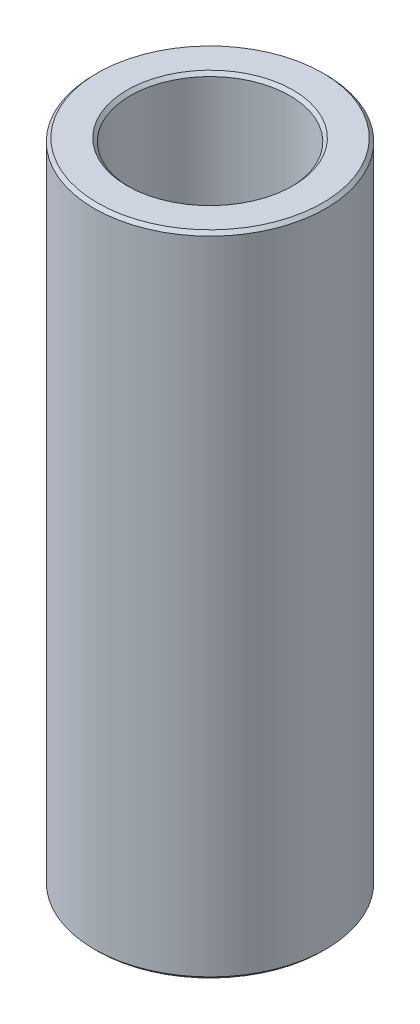
ISO-10303-21;
HEADER;
FILE_DESCRIPTION(('STEP AP214'),'2;1');
FILE_NAME('part.step','',(''),(''),'','','');
FILE_SCHEMA(('AUTOMOTIVE_DESIGN { 1 0 10303 214 1 1 1 1 }'));
ENDSEC;
DATA;
#1=APPLICATION_CONTEXT('core data for automotive mechanical design processes');
#2=APPLICATION_PROTOCOL_DEFINITION('international standard','automotive_design',2000,#1);
#3=PRODUCT_CONTEXT('',#1,'mechanical');
#4=PRODUCT('Part','Part','',(#3));
#5=PRODUCT_RELATED_PRODUCT_CATEGORY('part','',(#4));
#6=PRODUCT_DEFINITION_FORMATION('','',#4);
#7=PRODUCT_DEFINITION_CONTEXT('part definition',#1,'design');
#8=PRODUCT_DEFINITION('design','',#6,#7);
#9=PRODUCT_DEFINITION_SHAPE('','',#8);
#10=(LENGTH_UNIT() NAMED_UNIT(*) SI_UNIT(.MILLI.,.METRE.));
#11=(NAMED_UNIT(*) PLANE_ANGLE_UNIT() SI_UNIT($,.RADIAN.));
#12=(NAMED_UNIT(*) SI_UNIT($,.STERADIAN.) SOLID_ANGLE_UNIT());
#13=UNCERTAINTY_MEASURE_WITH_UNIT(LENGTH_MEASURE(1.E-05),#10,'distance_accuracy_value','');
#14=(GEOMETRIC_REPRESENTATION_CONTEXT(3) GLOBAL_UNCERTAINTY_ASSIGNED_CONTEXT((#13)) GLOBAL_UNIT_ASSIGNED_CONTEXT((#10,
#11,#12)) REPRESENTATION_CONTEXT('',''));
#15=CARTESIAN_POINT('',(0.,0.,0.));
#16=DIRECTION('',(0.,0.,1.));
#17=DIRECTION('',(1.,0.,0.));
#18=AXIS2_PLACEMENT_3D('',#15,#16,#17);
#19=CARTESIAN_POINT('',(0.,251.729088074632,0.));
#20=DIRECTION('',(0.,-1.,0.));
#21=DIRECTION('',(0.,0.,-1.));
#22=AXIS2_PLACEMENT_3D('',#19,#20,#21);
#23=CYLINDRICAL_SURFACE('',#22,45.);
#24=CARTESIAN_POINT('',(0.,1.25514584332964,0.));
#25=DIRECTION('',(0.,1.,0.));
#26=DIRECTION('',(0.,0.,1.));
#27=AXIS2_PLACEMENT_3D('',#24,#25,#26);
#28=CIRCLE('',#27,45.);
#29=CARTESIAN_POINT('',(0.,1.25514584332964,45.));
#30=VERTEX_POINT('',#29);
#31=EDGE_CURVE('E10',#30,#30,#28,.T.);
#32=ORIENTED_EDGE('',*,*,#31,.T.);
#33=EDGE_LOOP('',(#32));
#34=FACE_BOUND('',#33,.T.);
#35=CARTESIAN_POINT('',(0.,250.473942231302,0.));
#36=DIRECTION('',(0.,1.,0.));
#37=DIRECTION('',(0.,0.,1.));
#38=AXIS2_PLACEMENT_3D('',#35,#36,#37);
#39=CIRCLE('',#38,45.);
#40=CARTESIAN_POINT('',(0.,250.473942231302,45.));
#41=VERTEX_POINT('',#40);
#42=EDGE_CURVE('E50',#41,#41,#39,.F.);
#43=ORIENTED_EDGE('',*,*,#42,.T.);
#44=EDGE_LOOP('',(#43));
#45=FACE_BOUND('',#44,.T.);
#46=ADVANCED_FACE('F39',(#34,#45),#23,.T.);
#47=CARTESIAN_POINT('',(0.,251.729088074632,0.));
#48=DIRECTION('',(0.,1.,0.));
#49=DIRECTION('',(0.,0.,1.));
#50=AXIS2_PLACEMENT_3D('',#47,#48,#49);
#51=PLANE('',#50);
#52=CARTESIAN_POINT('',(0.,251.729088074632,0.));
#53=DIRECTION('',(0.,1.,0.));
#54=DIRECTION('',(0.,0.,1.));
#55=AXIS2_PLACEMENT_3D('',#52,#53,#54);
#56=CIRCLE('',#55,32.2402391536087);
#57=CARTESIAN_POINT('',(0.,251.729088074632,32.2402391536087));
#58=VERTEX_POINT('',#57);
#59=EDGE_CURVE('E58',#58,#58,#56,.F.);
#60=ORIENTED_EDGE('',*,*,#59,.T.);
#61=EDGE_LOOP('',(#60));
#62=FACE_BOUND('',#61,.T.);
#63=CARTESIAN_POINT('',(0.,251.729088074632,0.));
#64=DIRECTION('',(0.,1.,0.));
#65=DIRECTION('',(0.,0.,1.));
#66=AXIS2_PLACEMENT_3D('',#63,#64,#65);
#67=CIRCLE('',#66,43.7448541566703);
#68=CARTESIAN_POINT('',(0.,251.729088074632,43.7448541566703));
#69=VERTEX_POINT('',#68);
#70=EDGE_CURVE('E61',#69,#69,#67,.T.);
#71=ORIENTED_EDGE('',*,*,#70,.T.);
#72=EDGE_LOOP('',(#71));
#73=FACE_BOUND('',#72,.T.);
#74=ADVANCED_FACE('F88',(#62,#73),#51,.T.);
#75=CARTESIAN_POINT('',(0.,0.,0.));
#76=DIRECTION('',(0.,1.,0.));
#77=DIRECTION('',(0.,0.,1.));
#78=AXIS2_PLACEMENT_3D('',#75,#76,#77);
#79=PLANE('',#78);
#80=CARTESIAN_POINT('',(0.,0.,0.));
#81=DIRECTION('',(0.,1.,0.));
#82=DIRECTION('',(0.,0.,1.));
#83=AXIS2_PLACEMENT_3D('',#80,#81,#82);
#84=CIRCLE('',#83,32.2402391536086);
#85=CARTESIAN_POINT('',(0.,0.,32.2402391536086));
#86=VERTEX_POINT('',#85);
#87=EDGE_CURVE('E51',#86,#86,#84,.T.);
#88=ORIENTED_EDGE('',*,*,#87,.T.);
#89=EDGE_LOOP('',(#88));
#90=FACE_BOUND('',#89,.T.);
#91=CARTESIAN_POINT('',(0.,0.,0.));
#92=DIRECTION('',(0.,1.,0.));
#93=DIRECTION('',(0.,0.,1.));
#94=AXIS2_PLACEMENT_3D('',#91,#92,#93);
#95=CIRCLE('',#94,43.7448541566704);
#96=CARTESIAN_POINT('',(0.,0.,43.7448541566704));
#97=VERTEX_POINT('',#96);
#98=EDGE_CURVE('E54',#97,#97,#95,.F.);
#99=ORIENTED_EDGE('',*,*,#98,.T.);
#100=EDGE_LOOP('',(#99));
#101=FACE_BOUND('',#100,.T.);
#102=ADVANCED_FACE('F83',(#90,#101),#79,.F.);
#103=CARTESIAN_POINT('',(0.,251.729088074632,0.));
#104=DIRECTION('',(0.,-1.,0.));
#105=DIRECTION('',(0.,0.,-1.));
#106=AXIS2_PLACEMENT_3D('',#103,#104,#105);
#107=CYLINDRICAL_SURFACE('',#106,30.9850933102789);
#108=CARTESIAN_POINT('',(0.,250.473942231302,0.));
#109=DIRECTION('',(0.,1.,0.));
#110=DIRECTION('',(0.,0.,1.));
#111=AXIS2_PLACEMENT_3D('',#108,#109,#110);
#112=CIRCLE('',#111,30.9850933102789);
#113=CARTESIAN_POINT('',(0.,250.473942231302,30.9850933102789));
#114=VERTEX_POINT('',#113);
#115=EDGE_CURVE('E67',#114,#114,#112,.T.);
#116=ORIENTED_EDGE('',*,*,#115,.T.);
#117=EDGE_LOOP('',(#116));
#118=FACE_BOUND('',#117,.T.);
#119=CARTESIAN_POINT('',(0.,1.2551458433297,0.));
#120=DIRECTION('',(0.,1.,0.));
#121=DIRECTION('',(0.,0.,1.));
#122=AXIS2_PLACEMENT_3D('',#119,#120,#121);
#123=CIRCLE('',#122,30.9850933102789);
#124=CARTESIAN_POINT('',(0.,1.2551458433297,30.9850933102789));
#125=VERTEX_POINT('',#124);
#126=EDGE_CURVE('E69',#125,#125,#123,.F.);
#127=ORIENTED_EDGE('',*,*,#126,.T.);
#128=EDGE_LOOP('',(#127));
#129=FACE_BOUND('',#128,.T.);
#130=ADVANCED_FACE('F71',(#118,#129),#107,.F.);
#131=CARTESIAN_POINT('',(0.,250.473942231302,0.));
#132=DIRECTION('',(0.,1.,0.));
#133=DIRECTION('',(0.,0.,1.));
#134=AXIS2_PLACEMENT_3D('',#131,#132,#133);
#135=CONICAL_SURFACE('',#134,30.9850933102789,0.785398163397465);
#136=ORIENTED_EDGE('',*,*,#59,.F.);
#137=EDGE_LOOP('',(#136));
#138=FACE_BOUND('',#137,.T.);
#139=ORIENTED_EDGE('',*,*,#115,.F.);
#140=EDGE_LOOP('',(#139));
#141=FACE_BOUND('',#140,.T.);
#142=ADVANCED_FACE('F77',(#138,#141),#135,.F.);
#143=CARTESIAN_POINT('',(0.,0.,0.));
#144=DIRECTION('',(0.,-1.,0.));
#145=DIRECTION('',(0.,0.,-1.));
#146=AXIS2_PLACEMENT_3D('',#143,#144,#145);
#147=CONICAL_SURFACE('',#146,32.2402391536086,0.785398163397454);
#148=ORIENTED_EDGE('',*,*,#126,.F.);
#149=EDGE_LOOP('',(#148));
#150=FACE_BOUND('',#149,.T.);
#151=ORIENTED_EDGE('',*,*,#87,.F.);
#152=EDGE_LOOP('',(#151));
#153=FACE_BOUND('',#152,.T.);
#154=ADVANCED_FACE('F73',(#150,#153),#147,.F.);
#155=CARTESIAN_POINT('',(0.,1.25514584332964,0.));
#156=DIRECTION('',(0.,1.,0.));
#157=DIRECTION('',(0.,0.,1.));
#158=AXIS2_PLACEMENT_3D('',#155,#156,#157);
#159=CONICAL_SURFACE('',#158,45.,0.785398163397448);
#160=ORIENTED_EDGE('',*,*,#98,.F.);
#161=EDGE_LOOP('',(#160));
#162=FACE_BOUND('',#161,.T.);
#163=ORIENTED_EDGE('',*,*,#31,.F.);
#164=EDGE_LOOP('',(#163));
#165=FACE_BOUND('',#164,.T.);
#166=ADVANCED_FACE('F76',(#162,#165),#159,.T.);
#167=CARTESIAN_POINT('',(0.,251.729088074632,0.));
#168=DIRECTION('',(0.,-1.,0.));
#169=DIRECTION('',(0.,0.,-1.));
#170=AXIS2_PLACEMENT_3D('',#167,#168,#169);
#171=CONICAL_SURFACE('',#170,43.7448541566703,0.785398163397454);
#172=ORIENTED_EDGE('',*,*,#42,.F.);
#173=EDGE_LOOP('',(#172));
#174=FACE_BOUND('',#173,.T.);
#175=ORIENTED_EDGE('',*,*,#70,.F.);
#176=EDGE_LOOP('',(#175));
#177=FACE_BOUND('',#176,.T.);
#178=ADVANCED_FACE('F45',(#174,#177),#171,.T.);
#179=CLOSED_SHELL('',(#46,#74,#102,#130,#142,#154,#166,#178));
#180=MANIFOLD_SOLID_BREP('B2',#179);
#181=ADVANCED_BREP_SHAPE_REPRESENTATION('',(#18,#180),#14);
#182=SHAPE_DEFINITION_REPRESENTATION(#9,#181);
ENDSEC;
END-ISO-10303-21;
